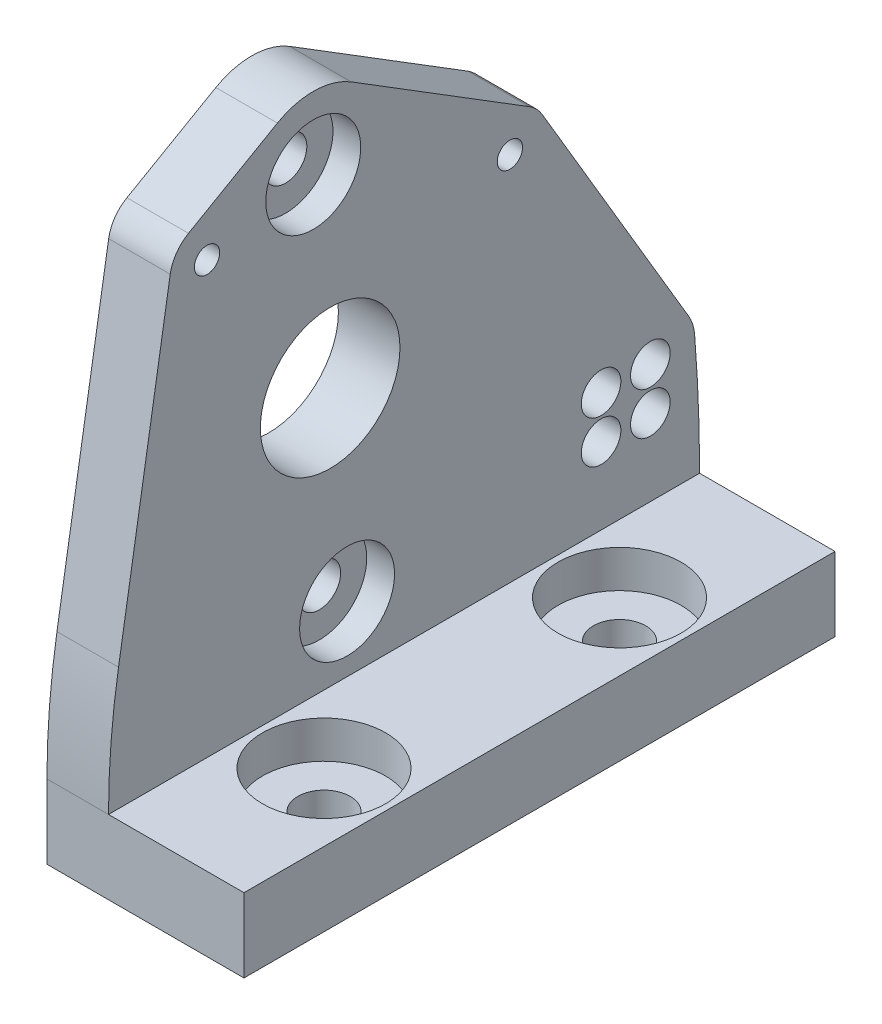
ISO-10303-21;
HEADER;
FILE_DESCRIPTION(('STEP AP214'),'2;1');
FILE_NAME('part.step','',(''),(''),'','','');
FILE_SCHEMA(('AUTOMOTIVE_DESIGN { 1 0 10303 214 1 1 1 1 }'));
ENDSEC;
DATA;
#1=APPLICATION_CONTEXT('core data for automotive mechanical design processes');
#2=APPLICATION_PROTOCOL_DEFINITION('international standard','automotive_design',2000,#1);
#3=PRODUCT_CONTEXT('',#1,'mechanical');
#4=PRODUCT('Part','Part','',(#3));
#5=PRODUCT_RELATED_PRODUCT_CATEGORY('part','',(#4));
#6=PRODUCT_DEFINITION_FORMATION('','',#4);
#7=PRODUCT_DEFINITION_CONTEXT('part definition',#1,'design');
#8=PRODUCT_DEFINITION('design','',#6,#7);
#9=PRODUCT_DEFINITION_SHAPE('','',#8);
#10=(LENGTH_UNIT() NAMED_UNIT(*) SI_UNIT(.MILLI.,.METRE.));
#11=(NAMED_UNIT(*) PLANE_ANGLE_UNIT() SI_UNIT($,.RADIAN.));
#12=(NAMED_UNIT(*) SI_UNIT($,.STERADIAN.) SOLID_ANGLE_UNIT());
#13=UNCERTAINTY_MEASURE_WITH_UNIT(LENGTH_MEASURE(1.E-05),#10,'distance_accuracy_value','');
#14=(GEOMETRIC_REPRESENTATION_CONTEXT(3) GLOBAL_UNCERTAINTY_ASSIGNED_CONTEXT((#13)) GLOBAL_UNIT_ASSIGNED_CONTEXT((#10,
#11,#12)) REPRESENTATION_CONTEXT('',''));
#15=CARTESIAN_POINT('',(0.,0.,0.));
#16=DIRECTION('',(0.,0.,1.));
#17=DIRECTION('',(1.,0.,0.));
#18=AXIS2_PLACEMENT_3D('',#15,#16,#17);
#19=CARTESIAN_POINT('',(9.525,79.375,76.2));
#20=DIRECTION('',(1.,0.,0.));
#21=DIRECTION('',(0.,-1.,0.));
#22=AXIS2_PLACEMENT_3D('',#19,#20,#21);
#23=PLANE('',#22);
#24=CARTESIAN_POINT('',(9.52499999999999,42.8625,47.625));
#25=DIRECTION('',(1.,0.,0.));
#26=DIRECTION('',(0.,0.,-1.));
#27=AXIS2_PLACEMENT_3D('',#24,#25,#26);
#28=CIRCLE('',#27,8.99999999999999);
#29=CARTESIAN_POINT('',(9.52499999999999,42.8625,38.625));
#30=VERTEX_POINT('',#29);
#31=EDGE_CURVE('E288',#30,#30,#28,.T.);
#32=ORIENTED_EDGE('',*,*,#31,.T.);
#33=EDGE_LOOP('',(#32));
#34=FACE_BOUND('',#33,.T.);
#35=CARTESIAN_POINT('',(9.52499999999999,17.957632509851,45.4461064279965));
#36=DIRECTION('',(-1.,0.,0.));
#37=DIRECTION('',(0.,-1.,0.));
#38=AXIS2_PLACEMENT_3D('',#35,#36,#37);
#39=CIRCLE('',#38,2.74999999999999);
#40=CARTESIAN_POINT('',(9.52499999999999,15.207632509851,45.4461064279965));
#41=VERTEX_POINT('',#40);
#42=EDGE_CURVE('E287',#41,#41,#39,.T.);
#43=ORIENTED_EDGE('',*,*,#42,.F.);
#44=EDGE_LOOP('',(#43));
#45=FACE_BOUND('',#44,.T.);
#46=CARTESIAN_POINT('',(9.525,67.767367490149,49.8038935720035));
#47=DIRECTION('',(-1.,0.,0.));
#48=DIRECTION('',(0.,-1.,0.));
#49=AXIS2_PLACEMENT_3D('',#46,#47,#48);
#50=CIRCLE('',#49,2.74999999999999);
#51=CARTESIAN_POINT('',(9.525,65.017367490149,49.8038935720035));
#52=VERTEX_POINT('',#51);
#53=EDGE_CURVE('E277',#52,#52,#50,.T.);
#54=ORIENTED_EDGE('',*,*,#53,.F.);
#55=EDGE_LOOP('',(#54));
#56=FACE_BOUND('',#55,.T.);
#57=CARTESIAN_POINT('',(9.525,65.0875,63.5));
#58=DIRECTION('',(1.,0.,0.));
#59=DIRECTION('',(0.,0.,-1.));
#60=AXIS2_PLACEMENT_3D('',#57,#58,#59);
#61=CIRCLE('',#60,2.77876000000001);
#62=CARTESIAN_POINT('',(9.525,65.0875,60.72124));
#63=VERTEX_POINT('',#62);
#64=EDGE_CURVE('E258',#63,#63,#61,.T.);
#65=ORIENTED_EDGE('',*,*,#64,.T.);
#66=EDGE_LOOP('',(#65));
#67=FACE_BOUND('',#66,.T.);
#68=CARTESIAN_POINT('',(9.525,57.3206231212675,24.4532731370692));
#69=DIRECTION('',(1.,0.,0.));
#70=DIRECTION('',(0.,0.,-1.));
#71=AXIS2_PLACEMENT_3D('',#68,#69,#70);
#72=CIRCLE('',#71,2.77876);
#73=CARTESIAN_POINT('',(9.525,57.3206231212675,21.6745131370692));
#74=VERTEX_POINT('',#73);
#75=EDGE_CURVE('E248',#74,#74,#72,.T.);
#76=ORIENTED_EDGE('',*,*,#75,.T.);
#77=EDGE_LOOP('',(#76));
#78=FACE_BOUND('',#77,.T.);
#79=CARTESIAN_POINT('',(9.52499999999999,19.3959598742133,12.7));
#80=DIRECTION('',(-1.,0.,0.));
#81=DIRECTION('',(0.,0.,1.));
#82=AXIS2_PLACEMENT_3D('',#79,#80,#81);
#83=CIRCLE('',#82,2.5527);
#84=CARTESIAN_POINT('',(9.52499999999999,19.3959598742133,15.2527));
#85=VERTEX_POINT('',#84);
#86=EDGE_CURVE('E245',#85,#85,#83,.T.);
#87=ORIENTED_EDGE('',*,*,#86,.F.);
#88=EDGE_LOOP('',(#87));
#89=FACE_BOUND('',#88,.T.);
#90=CARTESIAN_POINT('',(9.52499999999999,19.3959598742133,6.35));
#91=DIRECTION('',(-1.,0.,0.));
#92=DIRECTION('',(0.,0.,1.));
#93=AXIS2_PLACEMENT_3D('',#90,#91,#92);
#94=CIRCLE('',#93,2.5527);
#95=CARTESIAN_POINT('',(9.52499999999999,19.3959598742133,8.9027));
#96=VERTEX_POINT('',#95);
#97=EDGE_CURVE('E239',#96,#96,#94,.T.);
#98=ORIENTED_EDGE('',*,*,#97,.F.);
#99=EDGE_LOOP('',(#98));
#100=FACE_BOUND('',#99,.T.);
#101=CARTESIAN_POINT('',(9.52499999999999,24.8635494141295,12.7));
#102=DIRECTION('',(-1.,0.,0.));
#103=DIRECTION('',(0.,0.,1.));
#104=AXIS2_PLACEMENT_3D('',#101,#102,#103);
#105=CIRCLE('',#104,2.5527);
#106=CARTESIAN_POINT('',(9.52499999999999,24.8635494141295,15.2527));
#107=VERTEX_POINT('',#106);
#108=EDGE_CURVE('E233',#107,#107,#105,.T.);
#109=ORIENTED_EDGE('',*,*,#108,.F.);
#110=EDGE_LOOP('',(#109));
#111=FACE_BOUND('',#110,.T.);
#112=CARTESIAN_POINT('',(9.52499999999999,24.8635494141295,6.35));
#113=DIRECTION('',(-1.,0.,0.));
#114=DIRECTION('',(0.,0.,1.));
#115=AXIS2_PLACEMENT_3D('',#112,#113,#114);
#116=CIRCLE('',#115,2.5527);
#117=CARTESIAN_POINT('',(9.52499999999999,24.8635494141295,8.9027));
#118=VERTEX_POINT('',#117);
#119=EDGE_CURVE('E227',#118,#118,#116,.T.);
#120=ORIENTED_EDGE('',*,*,#119,.F.);
#121=EDGE_LOOP('',(#120));
#122=FACE_BOUND('',#121,.T.);
#123=CARTESIAN_POINT('',(9.52499999999999,9.525,195.072353237744));
#124=DIRECTION('',(1.,0.,0.));
#125=DIRECTION('',(0.,0.,-1.));
#126=AXIS2_PLACEMENT_3D('',#123,#124,#125);
#127=CIRCLE('',#126,195.072353237744);
#128=CARTESIAN_POINT('',(9.52499999999999,9.52500000000002,0.));
#129=VERTEX_POINT('',#128);
#130=CARTESIAN_POINT('',(9.52499999999999,25.3275424975202,0.641124654665709));
#131=VERTEX_POINT('',#130);
#132=EDGE_CURVE('E195',#129,#131,#127,.T.);
#133=ORIENTED_EDGE('',*,*,#132,.F.);
#134=DIRECTION('',(0.,1.,0.));
#135=VECTOR('',#134,1.);
#136=CARTESIAN_POINT('',(9.525,79.375,0.));
#137=LINE('',#136,#135);
#138=CARTESIAN_POINT('',(9.52499999999999,0.,0.));
#139=VERTEX_POINT('',#138);
#140=EDGE_CURVE('E304',#139,#129,#137,.T.);
#141=ORIENTED_EDGE('',*,*,#140,.F.);
#142=DIRECTION('',(0.,0.,-1.));
#143=VECTOR('',#142,1.);
#144=CARTESIAN_POINT('',(9.52499999999999,0.,76.2));
#145=LINE('',#144,#143);
#146=CARTESIAN_POINT('',(9.52499999999999,0.,76.2));
#147=VERTEX_POINT('',#146);
#148=EDGE_CURVE('E317',#147,#139,#145,.T.);
#149=ORIENTED_EDGE('',*,*,#148,.F.);
#150=DIRECTION('',(0.,1.,0.));
#151=VECTOR('',#150,1.);
#152=CARTESIAN_POINT('',(9.525,79.375,76.2));
#153=LINE('',#152,#151);
#154=CARTESIAN_POINT('',(9.52499999999999,9.525,76.2));
#155=VERTEX_POINT('',#154);
#156=EDGE_CURVE('E168',#147,#155,#153,.T.);
#157=ORIENTED_EDGE('',*,*,#156,.T.);
#158=CARTESIAN_POINT('',(9.52499999999999,9.525,-21.192786763509));
#159=DIRECTION('',(1.,0.,0.));
#160=DIRECTION('',(0.,0.,-1.));
#161=AXIS2_PLACEMENT_3D('',#158,#159,#160);
#162=CIRCLE('',#161,97.392786763509);
#163=CARTESIAN_POINT('',(9.52499999999999,25.3275424975202,74.9094221818446));
#164=VERTEX_POINT('',#163);
#165=EDGE_CURVE('E148',#164,#155,#162,.T.);
#166=ORIENTED_EDGE('',*,*,#165,.F.);
#167=DIRECTION('',(0.,-0.986748733032055,0.162255779125535));
#168=VECTOR('',#167,1.);
#169=CARTESIAN_POINT('',(9.52499999999999,12.6602209498388,76.9923700067049));
#170=LINE('',#169,#168);
#171=CARTESIAN_POINT('',(9.52499999999999,65.8674554174675,68.2432518222484));
#172=VERTEX_POINT('',#171);
#173=EDGE_CURVE('E159',#172,#164,#170,.T.);
#174=ORIENTED_EDGE('',*,*,#173,.F.);
#175=CARTESIAN_POINT('',(9.52499999999999,65.0875,63.5));
#176=DIRECTION('',(1.,0.,0.));
#177=DIRECTION('',(0.,0.,-1.));
#178=AXIS2_PLACEMENT_3D('',#175,#176,#177);
#179=CIRCLE('',#178,4.80694999999999);
#180=CARTESIAN_POINT('',(9.52499999999999,69.2575503932797,65.8911185708802));
#181=VERTEX_POINT('',#180);
#182=EDGE_CURVE('E164',#172,#181,#179,.F.);
#183=ORIENTED_EDGE('',*,*,#182,.T.);
#184=DIRECTION('',(0.,-0.497429465852599,0.867504424485315));
#185=VECTOR('',#184,1.);
#186=CARTESIAN_POINT('',(9.52499999999999,80.55421862798,46.1900144982694));
#187=LINE('',#186,#185);
#188=CARTESIAN_POINT('',(9.52499999999999,75.8308211157401,54.4275004571034));
#189=VERTEX_POINT('',#188);
#190=EDGE_CURVE('E177',#189,#181,#187,.T.);
#191=ORIENTED_EDGE('',*,*,#190,.F.);
#192=CARTESIAN_POINT('',(9.52499999999999,67.767367490149,49.8038935720035));
#193=DIRECTION('',(1.,0.,0.));
#194=DIRECTION('',(0.,0.,-1.));
#195=AXIS2_PLACEMENT_3D('',#192,#193,#194);
#196=CIRCLE('',#195,9.295);
#197=CARTESIAN_POINT('',(9.52499999999999,75.665670144044,44.9035017318059));
#198=VERTEX_POINT('',#197);
#199=EDGE_CURVE('E180',#189,#198,#196,.F.);
#200=ORIENTED_EDGE('',*,*,#199,.T.);
#201=DIRECTION('',(0.,0.527207298568868,0.849736702947281));
#202=VECTOR('',#201,1.);
#203=CARTESIAN_POINT('',(9.52499999999999,34.5183809760836,-21.416448556655));
#204=LINE('',#203,#202);
#205=CARTESIAN_POINT('',(9.52499999999999,61.4052649655,21.9190140132136));
#206=VERTEX_POINT('',#205);
#207=EDGE_CURVE('E183',#206,#198,#204,.T.);
#208=ORIENTED_EDGE('',*,*,#207,.F.);
#209=CARTESIAN_POINT('',(9.52499999999999,57.3206231212675,24.4532731370692));
#210=DIRECTION('',(1.,0.,0.));
#211=DIRECTION('',(0.,0.,-1.));
#212=AXIS2_PLACEMENT_3D('',#209,#210,#211);
#213=CIRCLE('',#212,4.80694999999999);
#214=CARTESIAN_POINT('',(9.52499999999999,59.7654438476144,20.3144786364296));
#215=VERTEX_POINT('',#214);
#216=EDGE_CURVE('E186',#206,#215,#213,.F.);
#217=ORIENTED_EDGE('',*,*,#216,.T.);
#218=DIRECTION('',(0.,-0.861002194871929,-0.508601239111468));
#219=VECTOR('',#218,1.);
#220=CARTESIAN_POINT('',(9.52499999999999,6.56399136927082,-11.1120668638873));
#221=LINE('',#220,#219);
#222=CARTESIAN_POINT('',(9.52499999999999,27.7766647313883,1.41843772843205));
#223=VERTEX_POINT('',#222);
#224=EDGE_CURVE('E189',#215,#223,#221,.T.);
#225=ORIENTED_EDGE('',*,*,#224,.T.);
#226=CARTESIAN_POINT('',(9.52499999999999,24.8635494141295,6.35));
#227=DIRECTION('',(1.,0.,0.));
#228=DIRECTION('',(0.,0.,-1.));
#229=AXIS2_PLACEMENT_3D('',#226,#227,#228);
#230=CIRCLE('',#229,5.7277);
#231=EDGE_CURVE('E192',#223,#131,#230,.F.);
#232=ORIENTED_EDGE('',*,*,#231,.T.);
#233=EDGE_LOOP('',(#133,#141,#149,#157,#166,#174,#183,#191,#200,#208,#217,#225,#232));
#234=FACE_BOUND('',#233,.T.);
#235=ADVANCED_FACE('F35',(#34,#45,#56,#67,#78,#89,#100,#111,#122,#234),#23,.F.);
#236=CARTESIAN_POINT('',(17.4625,9.525,76.2));
#237=DIRECTION('',(-1.,0.,0.));
#238=DIRECTION('',(0.,0.,-1.));
#239=AXIS2_PLACEMENT_3D('',#236,#237,#238);
#240=PLANE('',#239);
#241=CARTESIAN_POINT('',(17.4625,42.8625,47.625));
#242=DIRECTION('',(1.,0.,0.));
#243=DIRECTION('',(0.,0.,-1.));
#244=AXIS2_PLACEMENT_3D('',#241,#242,#243);
#245=CIRCLE('',#244,8.99999999999999);
#246=CARTESIAN_POINT('',(17.4625,42.8625,38.625));
#247=VERTEX_POINT('',#246);
#248=EDGE_CURVE('E291',#247,#247,#245,.T.);
#249=ORIENTED_EDGE('',*,*,#248,.F.);
#250=EDGE_LOOP('',(#249));
#251=FACE_BOUND('',#250,.T.);
#252=CARTESIAN_POINT('',(17.4625,17.957632509851,45.4461064279965));
#253=DIRECTION('',(-1.,0.,0.));
#254=DIRECTION('',(0.,0.,1.));
#255=AXIS2_PLACEMENT_3D('',#252,#253,#254);
#256=CIRCLE('',#255,6.12);
#257=CARTESIAN_POINT('',(17.4625,17.957632509851,51.5661064279965));
#258=VERTEX_POINT('',#257);
#259=EDGE_CURVE('E278',#258,#258,#256,.T.);
#260=ORIENTED_EDGE('',*,*,#259,.T.);
#261=EDGE_LOOP('',(#260));
#262=FACE_BOUND('',#261,.T.);
#263=CARTESIAN_POINT('',(17.4625,67.767367490149,49.8038935720035));
#264=DIRECTION('',(-1.,0.,0.));
#265=DIRECTION('',(0.,0.,1.));
#266=AXIS2_PLACEMENT_3D('',#263,#264,#265);
#267=CIRCLE('',#266,6.12);
#268=CARTESIAN_POINT('',(17.4625,67.767367490149,55.9238935720035));
#269=VERTEX_POINT('',#268);
#270=EDGE_CURVE('E268',#269,#269,#267,.T.);
#271=ORIENTED_EDGE('',*,*,#270,.T.);
#272=EDGE_LOOP('',(#271));
#273=FACE_BOUND('',#272,.T.);
#274=CARTESIAN_POINT('',(17.4625,65.0875,63.5));
#275=DIRECTION('',(1.,0.,0.));
#276=DIRECTION('',(0.,0.,-1.));
#277=AXIS2_PLACEMENT_3D('',#274,#275,#276);
#278=CIRCLE('',#277,1.63194999999999);
#279=CARTESIAN_POINT('',(17.4625,65.0875,61.86805));
#280=VERTEX_POINT('',#279);
#281=EDGE_CURVE('E267',#280,#280,#278,.T.);
#282=ORIENTED_EDGE('',*,*,#281,.F.);
#283=EDGE_LOOP('',(#282));
#284=FACE_BOUND('',#283,.T.);
#285=CARTESIAN_POINT('',(17.4625,57.3206231212675,24.4532731370692));
#286=DIRECTION('',(1.,0.,0.));
#287=DIRECTION('',(0.,0.,-1.));
#288=AXIS2_PLACEMENT_3D('',#285,#286,#287);
#289=CIRCLE('',#288,1.63194999999999);
#290=CARTESIAN_POINT('',(17.4625,57.3206231212675,22.8213231370692));
#291=VERTEX_POINT('',#290);
#292=EDGE_CURVE('E257',#291,#291,#289,.T.);
#293=ORIENTED_EDGE('',*,*,#292,.F.);
#294=EDGE_LOOP('',(#293));
#295=FACE_BOUND('',#294,.T.);
#296=CARTESIAN_POINT('',(17.4625,19.3959598742133,12.7));
#297=DIRECTION('',(-1.,0.,0.));
#298=DIRECTION('',(0.,0.,1.));
#299=AXIS2_PLACEMENT_3D('',#296,#297,#298);
#300=CIRCLE('',#299,2.5527);
#301=CARTESIAN_POINT('',(17.4625,19.3959598742133,15.2527));
#302=VERTEX_POINT('',#301);
#303=EDGE_CURVE('E242',#302,#302,#300,.T.);
#304=ORIENTED_EDGE('',*,*,#303,.T.);
#305=EDGE_LOOP('',(#304));
#306=FACE_BOUND('',#305,.T.);
#307=CARTESIAN_POINT('',(17.4625,19.3959598742133,6.35));
#308=DIRECTION('',(-1.,0.,0.));
#309=DIRECTION('',(0.,0.,1.));
#310=AXIS2_PLACEMENT_3D('',#307,#308,#309);
#311=CIRCLE('',#310,2.5527);
#312=CARTESIAN_POINT('',(17.4625,19.3959598742133,8.9027));
#313=VERTEX_POINT('',#312);
#314=EDGE_CURVE('E236',#313,#313,#311,.T.);
#315=ORIENTED_EDGE('',*,*,#314,.T.);
#316=EDGE_LOOP('',(#315));
#317=FACE_BOUND('',#316,.T.);
#318=CARTESIAN_POINT('',(17.4625,24.8635494141295,12.7));
#319=DIRECTION('',(-1.,0.,0.));
#320=DIRECTION('',(0.,0.,1.));
#321=AXIS2_PLACEMENT_3D('',#318,#319,#320);
#322=CIRCLE('',#321,2.5527);
#323=CARTESIAN_POINT('',(17.4625,24.8635494141295,15.2527));
#324=VERTEX_POINT('',#323);
#325=EDGE_CURVE('E230',#324,#324,#322,.T.);
#326=ORIENTED_EDGE('',*,*,#325,.T.);
#327=EDGE_LOOP('',(#326));
#328=FACE_BOUND('',#327,.T.);
#329=CARTESIAN_POINT('',(17.4625,24.8635494141295,6.35));
#330=DIRECTION('',(-1.,0.,0.));
#331=DIRECTION('',(0.,0.,1.));
#332=AXIS2_PLACEMENT_3D('',#329,#330,#331);
#333=CIRCLE('',#332,2.5527);
#334=CARTESIAN_POINT('',(17.4625,24.8635494141295,8.9027));
#335=VERTEX_POINT('',#334);
#336=EDGE_CURVE('E224',#335,#335,#333,.T.);
#337=ORIENTED_EDGE('',*,*,#336,.T.);
#338=EDGE_LOOP('',(#337));
#339=FACE_BOUND('',#338,.T.);
#340=CARTESIAN_POINT('',(17.4625,9.525,195.072353237744));
#341=DIRECTION('',(1.,0.,0.));
#342=DIRECTION('',(0.,0.,-1.));
#343=AXIS2_PLACEMENT_3D('',#340,#341,#342);
#344=CIRCLE('',#343,195.072353237744);
#345=CARTESIAN_POINT('',(17.4625,9.525,0.));
#346=VERTEX_POINT('',#345);
#347=CARTESIAN_POINT('',(17.4625,25.3275424975202,0.641124654665709));
#348=VERTEX_POINT('',#347);
#349=EDGE_CURVE('E217',#346,#348,#344,.T.);
#350=ORIENTED_EDGE('',*,*,#349,.T.);
#351=CARTESIAN_POINT('',(17.4625,24.8635494141295,6.35));
#352=DIRECTION('',(1.,0.,0.));
#353=DIRECTION('',(0.,0.,-1.));
#354=AXIS2_PLACEMENT_3D('',#351,#352,#353);
#355=CIRCLE('',#354,5.7277);
#356=CARTESIAN_POINT('',(17.4625,27.7766647313883,1.41843772843204));
#357=VERTEX_POINT('',#356);
#358=EDGE_CURVE('E11',#357,#348,#355,.F.);
#359=ORIENTED_EDGE('',*,*,#358,.F.);
#360=DIRECTION('',(0.,0.861002194871929,0.508601239111468));
#361=VECTOR('',#360,1.);
#362=CARTESIAN_POINT('',(17.4625,46.9936067737601,12.7700470424331));
#363=LINE('',#362,#361);
#364=CARTESIAN_POINT('',(17.4625,59.7654438476144,20.3144786364296));
#365=VERTEX_POINT('',#364);
#366=EDGE_CURVE('E319',#357,#365,#363,.T.);
#367=ORIENTED_EDGE('',*,*,#366,.T.);
#368=CARTESIAN_POINT('',(17.4625,57.3206231212675,24.4532731370692));
#369=DIRECTION('',(1.,0.,0.));
#370=DIRECTION('',(0.,0.,-1.));
#371=AXIS2_PLACEMENT_3D('',#368,#369,#370);
#372=CIRCLE('',#371,4.80694999999999);
#373=CARTESIAN_POINT('',(17.4625,61.4052649655,21.9190140132136));
#374=VERTEX_POINT('',#373);
#375=EDGE_CURVE('E330',#365,#374,#372,.T.);
#376=ORIENTED_EDGE('',*,*,#375,.T.);
#377=DIRECTION('',(0.,-0.527207298568868,-0.849736702947281));
#378=VECTOR('',#377,1.);
#379=CARTESIAN_POINT('',(17.4625,71.3024704974467,37.8710291312467));
#380=LINE('',#379,#378);
#381=CARTESIAN_POINT('',(17.4625,75.665670144044,44.9035017318059));
#382=VERTEX_POINT('',#381);
#383=EDGE_CURVE('E333',#382,#374,#380,.T.);
#384=ORIENTED_EDGE('',*,*,#383,.F.);
#385=CARTESIAN_POINT('',(17.4625,67.767367490149,49.8038935720035));
#386=DIRECTION('',(1.,0.,0.));
#387=DIRECTION('',(0.,0.,-1.));
#388=AXIS2_PLACEMENT_3D('',#385,#386,#387);
#389=CIRCLE('',#388,9.295);
#390=CARTESIAN_POINT('',(17.4625,75.8308211157401,54.4275004571034));
#391=VERTEX_POINT('',#390);
#392=EDGE_CURVE('E336',#382,#391,#389,.T.);
#393=ORIENTED_EDGE('',*,*,#392,.T.);
#394=DIRECTION('',(0.,0.497429465852599,-0.867504424485315));
#395=VECTOR('',#394,1.);
#396=CARTESIAN_POINT('',(17.4625,50.0290508258192,99.425136147412));
#397=LINE('',#396,#395);
#398=CARTESIAN_POINT('',(17.4625,69.2575503932797,65.8911185708802));
#399=VERTEX_POINT('',#398);
#400=EDGE_CURVE('E339',#399,#391,#397,.T.);
#401=ORIENTED_EDGE('',*,*,#400,.F.);
#402=CARTESIAN_POINT('',(17.4625,65.0875,63.5));
#403=DIRECTION('',(1.,0.,0.));
#404=DIRECTION('',(0.,0.,-1.));
#405=AXIS2_PLACEMENT_3D('',#402,#403,#404);
#406=CIRCLE('',#405,4.80694999999999);
#407=CARTESIAN_POINT('',(17.4625,65.8674554174675,68.2432518222484));
#408=VERTEX_POINT('',#407);
#409=EDGE_CURVE('E342',#399,#408,#406,.T.);
#410=ORIENTED_EDGE('',*,*,#409,.T.);
#411=DIRECTION('',(0.,0.986748733032055,-0.162255779125535));
#412=VECTOR('',#411,1.);
#413=CARTESIAN_POINT('',(17.4625,9.73440370940694,77.4734760269442));
#414=LINE('',#413,#412);
#415=CARTESIAN_POINT('',(17.4625,25.3275424975202,74.9094221818446));
#416=VERTEX_POINT('',#415);
#417=EDGE_CURVE('E43',#416,#408,#414,.T.);
#418=ORIENTED_EDGE('',*,*,#417,.F.);
#419=CARTESIAN_POINT('',(17.4625,9.525,-21.192786763509));
#420=DIRECTION('',(1.,0.,0.));
#421=DIRECTION('',(0.,0.,-1.));
#422=AXIS2_PLACEMENT_3D('',#419,#420,#421);
#423=CIRCLE('',#422,97.392786763509);
#424=CARTESIAN_POINT('',(17.4625,9.525,76.2));
#425=VERTEX_POINT('',#424);
#426=EDGE_CURVE('E151',#425,#416,#423,.F.);
#427=ORIENTED_EDGE('',*,*,#426,.F.);
#428=DIRECTION('',(0.,0.,-1.));
#429=VECTOR('',#428,1.);
#430=CARTESIAN_POINT('',(17.4625,9.525,76.2));
#431=LINE('',#430,#429);
#432=EDGE_CURVE('E314',#425,#346,#431,.T.);
#433=ORIENTED_EDGE('',*,*,#432,.T.);
#434=EDGE_LOOP('',(#350,#359,#367,#376,#384,#393,#401,#410,#418,#427,#433));
#435=FACE_BOUND('',#434,.T.);
#436=ADVANCED_FACE('F347',(#251,#262,#273,#284,#295,#306,#317,#328,#339,#435),#240,.F.);
#437=CARTESIAN_POINT('',(34.925,0.,76.2));
#438=DIRECTION('',(0.,0.,-1.));
#439=DIRECTION('',(1.,0.,0.));
#440=AXIS2_PLACEMENT_3D('',#437,#438,#439);
#441=PLANE('',#440);
#442=DIRECTION('',(1.,0.,0.));
#443=VECTOR('',#442,1.);
#444=CARTESIAN_POINT('',(9.52499999999999,9.525,76.2));
#445=LINE('',#444,#443);
#446=EDGE_CURVE('E196',#155,#425,#445,.T.);
#447=ORIENTED_EDGE('',*,*,#446,.F.);
#448=ORIENTED_EDGE('',*,*,#156,.F.);
#449=DIRECTION('',(-1.,0.,0.));
#450=VECTOR('',#449,1.);
#451=CARTESIAN_POINT('',(9.52499999999999,0.,76.2));
#452=LINE('',#451,#450);
#453=CARTESIAN_POINT('',(34.925,0.,76.2));
#454=VERTEX_POINT('',#453);
#455=EDGE_CURVE('E77',#454,#147,#452,.T.);
#456=ORIENTED_EDGE('',*,*,#455,.F.);
#457=DIRECTION('',(0.,-1.,0.));
#458=VECTOR('',#457,1.);
#459=CARTESIAN_POINT('',(34.925,0.,76.2));
#460=LINE('',#459,#458);
#461=CARTESIAN_POINT('',(34.925,9.525,76.2));
#462=VERTEX_POINT('',#461);
#463=EDGE_CURVE('E301',#462,#454,#460,.T.);
#464=ORIENTED_EDGE('',*,*,#463,.F.);
#465=DIRECTION('',(1.,0.,0.));
#466=VECTOR('',#465,1.);
#467=CARTESIAN_POINT('',(34.925,9.525,76.2));
#468=LINE('',#467,#466);
#469=EDGE_CURVE('E298',#425,#462,#468,.T.);
#470=ORIENTED_EDGE('',*,*,#469,.F.);
#471=EDGE_LOOP('',(#447,#448,#456,#464,#470));
#472=FACE_BOUND('',#471,.T.);
#473=ADVANCED_FACE('F391',(#472),#441,.F.);
#474=CARTESIAN_POINT('',(34.925,0.,0.));
#475=DIRECTION('',(0.,0.,-1.));
#476=DIRECTION('',(1.,0.,0.));
#477=AXIS2_PLACEMENT_3D('',#474,#475,#476);
#478=PLANE('',#477);
#479=DIRECTION('',(1.,0.,0.));
#480=VECTOR('',#479,1.);
#481=CARTESIAN_POINT('',(34.925,9.525,0.));
#482=LINE('',#481,#480);
#483=CARTESIAN_POINT('',(34.925,9.525,0.));
#484=VERTEX_POINT('',#483);
#485=EDGE_CURVE('E306',#346,#484,#482,.T.);
#486=ORIENTED_EDGE('',*,*,#485,.T.);
#487=DIRECTION('',(0.,-1.,0.));
#488=VECTOR('',#487,1.);
#489=CARTESIAN_POINT('',(34.925,0.,0.));
#490=LINE('',#489,#488);
#491=CARTESIAN_POINT('',(34.925,0.,0.));
#492=VERTEX_POINT('',#491);
#493=EDGE_CURVE('E296',#484,#492,#490,.T.);
#494=ORIENTED_EDGE('',*,*,#493,.T.);
#495=DIRECTION('',(-1.,0.,0.));
#496=VECTOR('',#495,1.);
#497=CARTESIAN_POINT('',(9.52499999999999,0.,0.));
#498=LINE('',#497,#496);
#499=EDGE_CURVE('E294',#492,#139,#498,.T.);
#500=ORIENTED_EDGE('',*,*,#499,.T.);
#501=ORIENTED_EDGE('',*,*,#140,.T.);
#502=DIRECTION('',(1.,0.,0.));
#503=VECTOR('',#502,1.);
#504=CARTESIAN_POINT('',(9.52499999999999,9.525,0.));
#505=LINE('',#504,#503);
#506=EDGE_CURVE('E50',#129,#346,#505,.T.);
#507=ORIENTED_EDGE('',*,*,#506,.T.);
#508=EDGE_LOOP('',(#486,#494,#500,#501,#507));
#509=FACE_BOUND('',#508,.T.);
#510=ADVANCED_FACE('F381',(#509),#478,.T.);
#511=CARTESIAN_POINT('',(9.52499999999999,0.,76.2));
#512=DIRECTION('',(0.,1.,0.));
#513=DIRECTION('',(0.,0.,1.));
#514=AXIS2_PLACEMENT_3D('',#511,#512,#513);
#515=PLANE('',#514);
#516=CARTESIAN_POINT('',(26.19375,0.,19.05));
#517=DIRECTION('',(0.,-1.,0.));
#518=DIRECTION('',(0.,0.,1.));
#519=AXIS2_PLACEMENT_3D('',#516,#517,#518);
#520=CIRCLE('',#519,3.3782);
#521=CARTESIAN_POINT('',(26.19375,0.,22.4282));
#522=VERTEX_POINT('',#521);
#523=EDGE_CURVE('E535',#522,#522,#520,.T.);
#524=ORIENTED_EDGE('',*,*,#523,.F.);
#525=EDGE_LOOP('',(#524));
#526=FACE_BOUND('',#525,.T.);
#527=CARTESIAN_POINT('',(26.19375,0.,57.15));
#528=DIRECTION('',(0.,-1.,0.));
#529=DIRECTION('',(0.,0.,1.));
#530=AXIS2_PLACEMENT_3D('',#527,#528,#529);
#531=CIRCLE('',#530,3.3782);
#532=CARTESIAN_POINT('',(26.19375,0.,60.5282));
#533=VERTEX_POINT('',#532);
#534=EDGE_CURVE('E169',#533,#533,#531,.T.);
#535=ORIENTED_EDGE('',*,*,#534,.F.);
#536=EDGE_LOOP('',(#535));
#537=FACE_BOUND('',#536,.T.);
#538=ORIENTED_EDGE('',*,*,#499,.F.);
#539=DIRECTION('',(0.,0.,-1.));
#540=VECTOR('',#539,1.);
#541=CARTESIAN_POINT('',(34.925,0.,76.2));
#542=LINE('',#541,#540);
#543=EDGE_CURVE('E59',#454,#492,#542,.T.);
#544=ORIENTED_EDGE('',*,*,#543,.F.);
#545=ORIENTED_EDGE('',*,*,#455,.T.);
#546=ORIENTED_EDGE('',*,*,#148,.T.);
#547=EDGE_LOOP('',(#538,#544,#545,#546));
#548=FACE_BOUND('',#547,.T.);
#549=ADVANCED_FACE('F37',(#526,#537,#548),#515,.F.);
#550=CARTESIAN_POINT('',(34.925,9.525,76.2));
#551=DIRECTION('',(0.,-1.,0.));
#552=DIRECTION('',(0.,0.,-1.));
#553=AXIS2_PLACEMENT_3D('',#550,#551,#552);
#554=PLANE('',#553);
#555=CARTESIAN_POINT('',(26.19375,9.525,19.05));
#556=DIRECTION('',(0.,-1.,0.));
#557=DIRECTION('',(0.,0.,1.));
#558=AXIS2_PLACEMENT_3D('',#555,#556,#557);
#559=CIRCLE('',#558,7.9375);
#560=CARTESIAN_POINT('',(26.19375,9.525,26.9875));
#561=VERTEX_POINT('',#560);
#562=EDGE_CURVE('E528',#561,#561,#559,.T.);
#563=ORIENTED_EDGE('',*,*,#562,.T.);
#564=EDGE_LOOP('',(#563));
#565=FACE_BOUND('',#564,.T.);
#566=CARTESIAN_POINT('',(26.19375,9.525,57.15));
#567=DIRECTION('',(0.,-1.,0.));
#568=DIRECTION('',(0.,0.,1.));
#569=AXIS2_PLACEMENT_3D('',#566,#567,#568);
#570=CIRCLE('',#569,7.9375);
#571=CARTESIAN_POINT('',(26.19375,9.525,65.0875));
#572=VERTEX_POINT('',#571);
#573=EDGE_CURVE('E538',#572,#572,#570,.T.);
#574=ORIENTED_EDGE('',*,*,#573,.T.);
#575=EDGE_LOOP('',(#574));
#576=FACE_BOUND('',#575,.T.);
#577=ORIENTED_EDGE('',*,*,#485,.F.);
#578=ORIENTED_EDGE('',*,*,#432,.F.);
#579=ORIENTED_EDGE('',*,*,#469,.T.);
#580=DIRECTION('',(0.,0.,-1.));
#581=VECTOR('',#580,1.);
#582=CARTESIAN_POINT('',(34.925,9.525,76.2));
#583=LINE('',#582,#581);
#584=EDGE_CURVE('E312',#462,#484,#583,.T.);
#585=ORIENTED_EDGE('',*,*,#584,.T.);
#586=EDGE_LOOP('',(#577,#578,#579,#585));
#587=FACE_BOUND('',#586,.T.);
#588=ADVANCED_FACE('F378',(#565,#576,#587),#554,.F.);
#589=CARTESIAN_POINT('',(34.925,0.,76.2));
#590=DIRECTION('',(-1.,0.,0.));
#591=DIRECTION('',(0.,0.,-1.));
#592=AXIS2_PLACEMENT_3D('',#589,#590,#591);
#593=PLANE('',#592);
#594=ORIENTED_EDGE('',*,*,#493,.F.);
#595=ORIENTED_EDGE('',*,*,#584,.F.);
#596=ORIENTED_EDGE('',*,*,#463,.T.);
#597=ORIENTED_EDGE('',*,*,#543,.T.);
#598=EDGE_LOOP('',(#594,#595,#596,#597));
#599=FACE_BOUND('',#598,.T.);
#600=ADVANCED_FACE('F388',(#599),#593,.F.);
#601=CARTESIAN_POINT('',(9.52499999999999,42.8625,47.625));
#602=DIRECTION('',(-1.,0.,0.));
#603=DIRECTION('',(0.,0.,-1.));
#604=AXIS2_PLACEMENT_3D('',#601,#602,#603);
#605=CYLINDRICAL_SURFACE('',#604,8.99999999999999);
#606=ORIENTED_EDGE('',*,*,#31,.F.);
#607=EDGE_LOOP('',(#606));
#608=FACE_BOUND('',#607,.T.);
#609=ORIENTED_EDGE('',*,*,#248,.T.);
#610=EDGE_LOOP('',(#609));
#611=FACE_BOUND('',#610,.T.);
#612=ADVANCED_FACE('F405',(#608,#611),#605,.F.);
#613=CARTESIAN_POINT('',(17.4625,17.957632509851,45.4461064279965));
#614=DIRECTION('',(1.,0.,0.));
#615=DIRECTION('',(0.,0.,1.));
#616=AXIS2_PLACEMENT_3D('',#613,#614,#615);
#617=CYLINDRICAL_SURFACE('',#616,2.74999999999999);
#618=CARTESIAN_POINT('',(13.8825,17.957632509851,45.4461064279965));
#619=DIRECTION('',(-1.,0.,0.));
#620=DIRECTION('',(0.,0.,1.));
#621=AXIS2_PLACEMENT_3D('',#618,#619,#620);
#622=CIRCLE('',#621,2.75);
#623=CARTESIAN_POINT('',(13.8825,17.957632509851,48.1961064279965));
#624=VERTEX_POINT('',#623);
#625=EDGE_CURVE('E284',#624,#624,#622,.T.);
#626=ORIENTED_EDGE('',*,*,#625,.F.);
#627=EDGE_LOOP('',(#626));
#628=FACE_BOUND('',#627,.T.);
#629=ORIENTED_EDGE('',*,*,#42,.T.);
#630=EDGE_LOOP('',(#629));
#631=FACE_BOUND('',#630,.T.);
#632=ADVANCED_FACE('F412',(#628,#631),#617,.F.);
#633=CARTESIAN_POINT('',(13.8825,20.707632509851,45.4461064279965));
#634=DIRECTION('',(-1.,0.,0.));
#635=DIRECTION('',(0.,0.,-1.));
#636=AXIS2_PLACEMENT_3D('',#633,#634,#635);
#637=PLANE('',#636);
#638=ORIENTED_EDGE('',*,*,#625,.T.);
#639=EDGE_LOOP('',(#638));
#640=FACE_BOUND('',#639,.T.);
#641=CARTESIAN_POINT('',(13.8825,17.957632509851,45.4461064279965));
#642=DIRECTION('',(-1.,0.,0.));
#643=DIRECTION('',(0.,0.,1.));
#644=AXIS2_PLACEMENT_3D('',#641,#642,#643);
#645=CIRCLE('',#644,6.12);
#646=CARTESIAN_POINT('',(13.8825,17.957632509851,51.5661064279965));
#647=VERTEX_POINT('',#646);
#648=EDGE_CURVE('E281',#647,#647,#645,.T.);
#649=ORIENTED_EDGE('',*,*,#648,.F.);
#650=EDGE_LOOP('',(#649));
#651=FACE_BOUND('',#650,.T.);
#652=ADVANCED_FACE('F416',(#640,#651),#637,.F.);
#653=CARTESIAN_POINT('',(17.4625,17.957632509851,45.4461064279965));
#654=DIRECTION('',(1.,0.,0.));
#655=DIRECTION('',(0.,0.,1.));
#656=AXIS2_PLACEMENT_3D('',#653,#654,#655);
#657=CYLINDRICAL_SURFACE('',#656,6.12);
#658=ORIENTED_EDGE('',*,*,#648,.T.);
#659=EDGE_LOOP('',(#658));
#660=FACE_BOUND('',#659,.T.);
#661=ORIENTED_EDGE('',*,*,#259,.F.);
#662=EDGE_LOOP('',(#661));
#663=FACE_BOUND('',#662,.T.);
#664=ADVANCED_FACE('F420',(#660,#663),#657,.F.);
#665=CARTESIAN_POINT('',(17.4625,67.767367490149,49.8038935720035));
#666=DIRECTION('',(1.,0.,0.));
#667=DIRECTION('',(0.,0.,1.));
#668=AXIS2_PLACEMENT_3D('',#665,#666,#667);
#669=CYLINDRICAL_SURFACE('',#668,2.74999999999999);
#670=CARTESIAN_POINT('',(13.8825,67.767367490149,49.8038935720035));
#671=DIRECTION('',(-1.,0.,0.));
#672=DIRECTION('',(0.,0.,1.));
#673=AXIS2_PLACEMENT_3D('',#670,#671,#672);
#674=CIRCLE('',#673,2.74999999999999);
#675=CARTESIAN_POINT('',(13.8825,67.767367490149,52.5538935720035));
#676=VERTEX_POINT('',#675);
#677=EDGE_CURVE('E274',#676,#676,#674,.T.);
#678=ORIENTED_EDGE('',*,*,#677,.F.);
#679=EDGE_LOOP('',(#678));
#680=FACE_BOUND('',#679,.T.);
#681=ORIENTED_EDGE('',*,*,#53,.T.);
#682=EDGE_LOOP('',(#681));
#683=FACE_BOUND('',#682,.T.);
#684=ADVANCED_FACE('F424',(#680,#683),#669,.F.);
#685=CARTESIAN_POINT('',(13.8825,70.517367490149,49.8038935720035));
#686=DIRECTION('',(-1.,0.,0.));
#687=DIRECTION('',(0.,0.,-1.));
#688=AXIS2_PLACEMENT_3D('',#685,#686,#687);
#689=PLANE('',#688);
#690=ORIENTED_EDGE('',*,*,#677,.T.);
#691=EDGE_LOOP('',(#690));
#692=FACE_BOUND('',#691,.T.);
#693=CARTESIAN_POINT('',(13.8825,67.767367490149,49.8038935720035));
#694=DIRECTION('',(-1.,0.,0.));
#695=DIRECTION('',(0.,0.,1.));
#696=AXIS2_PLACEMENT_3D('',#693,#694,#695);
#697=CIRCLE('',#696,6.12);
#698=CARTESIAN_POINT('',(13.8825,67.767367490149,55.9238935720035));
#699=VERTEX_POINT('',#698);
#700=EDGE_CURVE('E271',#699,#699,#697,.T.);
#701=ORIENTED_EDGE('',*,*,#700,.F.);
#702=EDGE_LOOP('',(#701));
#703=FACE_BOUND('',#702,.T.);
#704=ADVANCED_FACE('F428',(#692,#703),#689,.F.);
#705=CARTESIAN_POINT('',(17.4625,67.767367490149,49.8038935720035));
#706=DIRECTION('',(1.,0.,0.));
#707=DIRECTION('',(0.,0.,1.));
#708=AXIS2_PLACEMENT_3D('',#705,#706,#707);
#709=CYLINDRICAL_SURFACE('',#708,6.12);
#710=ORIENTED_EDGE('',*,*,#700,.T.);
#711=EDGE_LOOP('',(#710));
#712=FACE_BOUND('',#711,.T.);
#713=ORIENTED_EDGE('',*,*,#270,.F.);
#714=EDGE_LOOP('',(#713));
#715=FACE_BOUND('',#714,.T.);
#716=ADVANCED_FACE('F432',(#712,#715),#709,.F.);
#717=CARTESIAN_POINT('',(9.525,65.0875,63.5));
#718=DIRECTION('',(-1.,0.,0.));
#719=DIRECTION('',(0.,0.,-1.));
#720=AXIS2_PLACEMENT_3D('',#717,#718,#719);
#721=CYLINDRICAL_SURFACE('',#720,1.63194999999999);
#722=CARTESIAN_POINT('',(12.3698,65.0875,63.5));
#723=DIRECTION('',(1.,0.,0.));
#724=DIRECTION('',(0.,0.,-1.));
#725=AXIS2_PLACEMENT_3D('',#722,#723,#724);
#726=CIRCLE('',#725,1.63194999999999);
#727=CARTESIAN_POINT('',(12.3698,65.0875,61.86805));
#728=VERTEX_POINT('',#727);
#729=EDGE_CURVE('E264',#728,#728,#726,.T.);
#730=ORIENTED_EDGE('',*,*,#729,.F.);
#731=EDGE_LOOP('',(#730));
#732=FACE_BOUND('',#731,.T.);
#733=ORIENTED_EDGE('',*,*,#281,.T.);
#734=EDGE_LOOP('',(#733));
#735=FACE_BOUND('',#734,.T.);
#736=ADVANCED_FACE('F436',(#732,#735),#721,.F.);
#737=CARTESIAN_POINT('',(12.3698,66.71945,63.5));
#738=DIRECTION('',(1.,0.,0.));
#739=DIRECTION('',(0.,0.,1.));
#740=AXIS2_PLACEMENT_3D('',#737,#738,#739);
#741=PLANE('',#740);
#742=ORIENTED_EDGE('',*,*,#729,.T.);
#743=EDGE_LOOP('',(#742));
#744=FACE_BOUND('',#743,.T.);
#745=CARTESIAN_POINT('',(12.3698,65.0875,63.5));
#746=DIRECTION('',(1.,0.,0.));
#747=DIRECTION('',(0.,0.,-1.));
#748=AXIS2_PLACEMENT_3D('',#745,#746,#747);
#749=CIRCLE('',#748,2.77876000000001);
#750=CARTESIAN_POINT('',(12.3698,65.0875,60.72124));
#751=VERTEX_POINT('',#750);
#752=EDGE_CURVE('E261',#751,#751,#749,.T.);
#753=ORIENTED_EDGE('',*,*,#752,.F.);
#754=EDGE_LOOP('',(#753));
#755=FACE_BOUND('',#754,.T.);
#756=ADVANCED_FACE('F440',(#744,#755),#741,.F.);
#757=CARTESIAN_POINT('',(9.525,65.0875,63.5));
#758=DIRECTION('',(-1.,0.,0.));
#759=DIRECTION('',(0.,0.,-1.));
#760=AXIS2_PLACEMENT_3D('',#757,#758,#759);
#761=CYLINDRICAL_SURFACE('',#760,2.77876000000001);
#762=ORIENTED_EDGE('',*,*,#752,.T.);
#763=EDGE_LOOP('',(#762));
#764=FACE_BOUND('',#763,.T.);
#765=ORIENTED_EDGE('',*,*,#64,.F.);
#766=EDGE_LOOP('',(#765));
#767=FACE_BOUND('',#766,.T.);
#768=ADVANCED_FACE('F444',(#764,#767),#761,.F.);
#769=CARTESIAN_POINT('',(9.525,57.3206231212675,24.4532731370692));
#770=DIRECTION('',(-1.,0.,0.));
#771=DIRECTION('',(0.,0.,-1.));
#772=AXIS2_PLACEMENT_3D('',#769,#770,#771);
#773=CYLINDRICAL_SURFACE('',#772,1.63194999999999);
#774=CARTESIAN_POINT('',(12.3698,57.3206231212675,24.4532731370692));
#775=DIRECTION('',(1.,0.,0.));
#776=DIRECTION('',(0.,0.,-1.));
#777=AXIS2_PLACEMENT_3D('',#774,#775,#776);
#778=CIRCLE('',#777,1.63194999999999);
#779=CARTESIAN_POINT('',(12.3698,57.3206231212675,22.8213231370692));
#780=VERTEX_POINT('',#779);
#781=EDGE_CURVE('E254',#780,#780,#778,.T.);
#782=ORIENTED_EDGE('',*,*,#781,.F.);
#783=EDGE_LOOP('',(#782));
#784=FACE_BOUND('',#783,.T.);
#785=ORIENTED_EDGE('',*,*,#292,.T.);
#786=EDGE_LOOP('',(#785));
#787=FACE_BOUND('',#786,.T.);
#788=ADVANCED_FACE('F448',(#784,#787),#773,.F.);
#789=CARTESIAN_POINT('',(12.3698,58.9525731212675,24.4532731370692));
#790=DIRECTION('',(1.,0.,0.));
#791=DIRECTION('',(0.,0.,1.));
#792=AXIS2_PLACEMENT_3D('',#789,#790,#791);
#793=PLANE('',#792);
#794=ORIENTED_EDGE('',*,*,#781,.T.);
#795=EDGE_LOOP('',(#794));
#796=FACE_BOUND('',#795,.T.);
#797=CARTESIAN_POINT('',(12.3698,57.3206231212675,24.4532731370692));
#798=DIRECTION('',(1.,0.,0.));
#799=DIRECTION('',(0.,0.,-1.));
#800=AXIS2_PLACEMENT_3D('',#797,#798,#799);
#801=CIRCLE('',#800,2.77876);
#802=CARTESIAN_POINT('',(12.3698,57.3206231212675,21.6745131370692));
#803=VERTEX_POINT('',#802);
#804=EDGE_CURVE('E251',#803,#803,#801,.T.);
#805=ORIENTED_EDGE('',*,*,#804,.F.);
#806=EDGE_LOOP('',(#805));
#807=FACE_BOUND('',#806,.T.);
#808=ADVANCED_FACE('F452',(#796,#807),#793,.F.);
#809=CARTESIAN_POINT('',(9.525,57.3206231212675,24.4532731370692));
#810=DIRECTION('',(-1.,0.,0.));
#811=DIRECTION('',(0.,0.,-1.));
#812=AXIS2_PLACEMENT_3D('',#809,#810,#811);
#813=CYLINDRICAL_SURFACE('',#812,2.77876);
#814=ORIENTED_EDGE('',*,*,#804,.T.);
#815=EDGE_LOOP('',(#814));
#816=FACE_BOUND('',#815,.T.);
#817=ORIENTED_EDGE('',*,*,#75,.F.);
#818=EDGE_LOOP('',(#817));
#819=FACE_BOUND('',#818,.T.);
#820=ADVANCED_FACE('F456',(#816,#819),#813,.F.);
#821=CARTESIAN_POINT('',(17.4625,19.3959598742133,12.7));
#822=DIRECTION('',(1.,0.,0.));
#823=DIRECTION('',(0.,0.,1.));
#824=AXIS2_PLACEMENT_3D('',#821,#822,#823);
#825=CYLINDRICAL_SURFACE('',#824,2.5527);
#826=ORIENTED_EDGE('',*,*,#86,.T.);
#827=EDGE_LOOP('',(#826));
#828=FACE_BOUND('',#827,.T.);
#829=ORIENTED_EDGE('',*,*,#303,.F.);
#830=EDGE_LOOP('',(#829));
#831=FACE_BOUND('',#830,.T.);
#832=ADVANCED_FACE('F460',(#828,#831),#825,.F.);
#833=CARTESIAN_POINT('',(17.4625,19.3959598742133,6.35));
#834=DIRECTION('',(1.,0.,0.));
#835=DIRECTION('',(0.,0.,1.));
#836=AXIS2_PLACEMENT_3D('',#833,#834,#835);
#837=CYLINDRICAL_SURFACE('',#836,2.5527);
#838=ORIENTED_EDGE('',*,*,#97,.T.);
#839=EDGE_LOOP('',(#838));
#840=FACE_BOUND('',#839,.T.);
#841=ORIENTED_EDGE('',*,*,#314,.F.);
#842=EDGE_LOOP('',(#841));
#843=FACE_BOUND('',#842,.T.);
#844=ADVANCED_FACE('F464',(#840,#843),#837,.F.);
#845=CARTESIAN_POINT('',(17.4625,24.8635494141295,12.7));
#846=DIRECTION('',(1.,0.,0.));
#847=DIRECTION('',(0.,0.,1.));
#848=AXIS2_PLACEMENT_3D('',#845,#846,#847);
#849=CYLINDRICAL_SURFACE('',#848,2.5527);
#850=ORIENTED_EDGE('',*,*,#108,.T.);
#851=EDGE_LOOP('',(#850));
#852=FACE_BOUND('',#851,.T.);
#853=ORIENTED_EDGE('',*,*,#325,.F.);
#854=EDGE_LOOP('',(#853));
#855=FACE_BOUND('',#854,.T.);
#856=ADVANCED_FACE('F468',(#852,#855),#849,.F.);
#857=CARTESIAN_POINT('',(17.4625,24.8635494141295,6.35));
#858=DIRECTION('',(1.,0.,0.));
#859=DIRECTION('',(0.,0.,1.));
#860=AXIS2_PLACEMENT_3D('',#857,#858,#859);
#861=CYLINDRICAL_SURFACE('',#860,2.5527);
#862=ORIENTED_EDGE('',*,*,#119,.T.);
#863=EDGE_LOOP('',(#862));
#864=FACE_BOUND('',#863,.T.);
#865=ORIENTED_EDGE('',*,*,#336,.F.);
#866=EDGE_LOOP('',(#865));
#867=FACE_BOUND('',#866,.T.);
#868=ADVANCED_FACE('F472',(#864,#867),#861,.F.);
#869=CARTESIAN_POINT('',(34.925012,24.8635494141295,6.35));
#870=DIRECTION('',(-1.,0.,0.));
#871=DIRECTION('',(0.,0.,-1.));
#872=AXIS2_PLACEMENT_3D('',#869,#870,#871);
#873=CYLINDRICAL_SURFACE('',#872,5.7277);
#874=DIRECTION('',(1.,0.,0.));
#875=VECTOR('',#874,1.);
#876=CARTESIAN_POINT('',(9.52499999999999,27.7766647313883,1.41843772843205));
#877=LINE('',#876,#875);
#878=EDGE_CURVE('E204',#223,#357,#877,.T.);
#879=ORIENTED_EDGE('',*,*,#878,.T.);
#880=ORIENTED_EDGE('',*,*,#358,.T.);
#881=DIRECTION('',(-1.,0.,0.));
#882=VECTOR('',#881,1.);
#883=CARTESIAN_POINT('',(34.925012,25.3275424975202,0.641124654665709));
#884=LINE('',#883,#882);
#885=EDGE_CURVE('E155',#348,#131,#884,.T.);
#886=ORIENTED_EDGE('',*,*,#885,.T.);
#887=ORIENTED_EDGE('',*,*,#231,.F.);
#888=EDGE_LOOP('',(#879,#880,#886,#887));
#889=FACE_BOUND('',#888,.T.);
#890=ADVANCED_FACE('F372',(#889),#873,.T.);
#891=CARTESIAN_POINT('',(9.52499999999999,12.6602209498388,76.9923700067049));
#892=DIRECTION('',(0.,-0.162255779125535,-0.986748733032055));
#893=DIRECTION('',(0.,0.986748733032055,-0.162255779125535));
#894=AXIS2_PLACEMENT_3D('',#891,#892,#893);
#895=PLANE('',#894);
#896=DIRECTION('',(1.,0.,0.));
#897=VECTOR('',#896,1.);
#898=CARTESIAN_POINT('',(9.52499999999999,25.3275424975202,74.9094221818446));
#899=LINE('',#898,#897);
#900=EDGE_CURVE('E143',#164,#416,#899,.T.);
#901=ORIENTED_EDGE('',*,*,#900,.T.);
#902=ORIENTED_EDGE('',*,*,#417,.T.);
#903=DIRECTION('',(1.,0.,0.));
#904=VECTOR('',#903,1.);
#905=CARTESIAN_POINT('',(9.52499999999999,65.8674554174675,68.2432518222484));
#906=LINE('',#905,#904);
#907=EDGE_CURVE('E156',#172,#408,#906,.T.);
#908=ORIENTED_EDGE('',*,*,#907,.F.);
#909=ORIENTED_EDGE('',*,*,#173,.T.);
#910=EDGE_LOOP('',(#901,#902,#908,#909));
#911=FACE_BOUND('',#910,.T.);
#912=ADVANCED_FACE('F160',(#911),#895,.F.);
#913=CARTESIAN_POINT('',(9.52499999999999,65.0875,63.5));
#914=DIRECTION('',(1.,0.,0.));
#915=DIRECTION('',(0.,0.,1.));
#916=AXIS2_PLACEMENT_3D('',#913,#914,#915);
#917=CYLINDRICAL_SURFACE('',#916,4.80694999999999);
#918=ORIENTED_EDGE('',*,*,#409,.F.);
#919=DIRECTION('',(1.,0.,0.));
#920=VECTOR('',#919,1.);
#921=CARTESIAN_POINT('',(9.52499999999999,69.2575503932797,65.8911185708802));
#922=LINE('',#921,#920);
#923=EDGE_CURVE('E213',#181,#399,#922,.T.);
#924=ORIENTED_EDGE('',*,*,#923,.F.);
#925=ORIENTED_EDGE('',*,*,#182,.F.);
#926=ORIENTED_EDGE('',*,*,#907,.T.);
#927=EDGE_LOOP('',(#918,#924,#925,#926));
#928=FACE_BOUND('',#927,.T.);
#929=ADVANCED_FACE('F349',(#928),#917,.T.);
#930=CARTESIAN_POINT('',(9.52499999999999,80.55421862798,46.1900144982694));
#931=DIRECTION('',(0.,-0.867504424485315,-0.497429465852599));
#932=DIRECTION('',(0.,0.497429465852599,-0.867504424485315));
#933=AXIS2_PLACEMENT_3D('',#930,#931,#932);
#934=PLANE('',#933);
#935=ORIENTED_EDGE('',*,*,#923,.T.);
#936=ORIENTED_EDGE('',*,*,#400,.T.);
#937=DIRECTION('',(1.,0.,0.));
#938=VECTOR('',#937,1.);
#939=CARTESIAN_POINT('',(9.52499999999999,75.8308211157401,54.4275004571034));
#940=LINE('',#939,#938);
#941=EDGE_CURVE('E211',#189,#391,#940,.T.);
#942=ORIENTED_EDGE('',*,*,#941,.F.);
#943=ORIENTED_EDGE('',*,*,#190,.T.);
#944=EDGE_LOOP('',(#935,#936,#942,#943));
#945=FACE_BOUND('',#944,.T.);
#946=ADVANCED_FACE('F354',(#945),#934,.F.);
#947=CARTESIAN_POINT('',(9.52499999999999,67.767367490149,49.8038935720035));
#948=DIRECTION('',(1.,0.,0.));
#949=DIRECTION('',(0.,0.,1.));
#950=AXIS2_PLACEMENT_3D('',#947,#948,#949);
#951=CYLINDRICAL_SURFACE('',#950,9.295);
#952=ORIENTED_EDGE('',*,*,#392,.F.);
#953=DIRECTION('',(1.,0.,0.));
#954=VECTOR('',#953,1.);
#955=CARTESIAN_POINT('',(9.52499999999999,75.665670144044,44.9035017318059));
#956=LINE('',#955,#954);
#957=EDGE_CURVE('E209',#198,#382,#956,.T.);
#958=ORIENTED_EDGE('',*,*,#957,.F.);
#959=ORIENTED_EDGE('',*,*,#199,.F.);
#960=ORIENTED_EDGE('',*,*,#941,.T.);
#961=EDGE_LOOP('',(#952,#958,#959,#960));
#962=FACE_BOUND('',#961,.T.);
#963=ADVANCED_FACE('F357',(#962),#951,.T.);
#964=CARTESIAN_POINT('',(9.52499999999999,34.5183809760836,-21.416448556655));
#965=DIRECTION('',(0.,-0.849736702947281,0.527207298568868));
#966=DIRECTION('',(0.,-0.527207298568868,-0.849736702947281));
#967=AXIS2_PLACEMENT_3D('',#964,#965,#966);
#968=PLANE('',#967);
#969=ORIENTED_EDGE('',*,*,#957,.T.);
#970=ORIENTED_EDGE('',*,*,#383,.T.);
#971=DIRECTION('',(1.,0.,0.));
#972=VECTOR('',#971,1.);
#973=CARTESIAN_POINT('',(9.52499999999999,61.4052649655,21.9190140132136));
#974=LINE('',#973,#972);
#975=EDGE_CURVE('E203',#206,#374,#974,.T.);
#976=ORIENTED_EDGE('',*,*,#975,.F.);
#977=ORIENTED_EDGE('',*,*,#207,.T.);
#978=EDGE_LOOP('',(#969,#970,#976,#977));
#979=FACE_BOUND('',#978,.T.);
#980=ADVANCED_FACE('F360',(#979),#968,.F.);
#981=CARTESIAN_POINT('',(9.52499999999999,57.3206231212675,24.4532731370692));
#982=DIRECTION('',(1.,0.,0.));
#983=DIRECTION('',(0.,0.,1.));
#984=AXIS2_PLACEMENT_3D('',#981,#982,#983);
#985=CYLINDRICAL_SURFACE('',#984,4.80694999999999);
#986=ORIENTED_EDGE('',*,*,#375,.F.);
#987=DIRECTION('',(1.,0.,0.));
#988=VECTOR('',#987,1.);
#989=CARTESIAN_POINT('',(9.52499999999999,59.7654438476144,20.3144786364296));
#990=LINE('',#989,#988);
#991=EDGE_CURVE('E201',#215,#365,#990,.T.);
#992=ORIENTED_EDGE('',*,*,#991,.F.);
#993=ORIENTED_EDGE('',*,*,#216,.F.);
#994=ORIENTED_EDGE('',*,*,#975,.T.);
#995=EDGE_LOOP('',(#986,#992,#993,#994));
#996=FACE_BOUND('',#995,.T.);
#997=ADVANCED_FACE('F365',(#996),#985,.T.);
#998=CARTESIAN_POINT('',(9.52499999999999,6.56399136927082,-11.1120668638873));
#999=DIRECTION('',(0.,0.508601239111468,-0.861002194871929));
#1000=DIRECTION('',(0.,0.861002194871929,0.508601239111468));
#1001=AXIS2_PLACEMENT_3D('',#998,#999,#1000);
#1002=PLANE('',#1001);
#1003=ORIENTED_EDGE('',*,*,#366,.F.);
#1004=ORIENTED_EDGE('',*,*,#878,.F.);
#1005=ORIENTED_EDGE('',*,*,#224,.F.);
#1006=ORIENTED_EDGE('',*,*,#991,.T.);
#1007=EDGE_LOOP('',(#1003,#1004,#1005,#1006));
#1008=FACE_BOUND('',#1007,.T.);
#1009=ADVANCED_FACE('F368',(#1008),#1002,.T.);
#1010=CARTESIAN_POINT('',(9.52499999999999,9.525,-21.192786763509));
#1011=DIRECTION('',(1.,0.,0.));
#1012=DIRECTION('',(0.,0.,1.));
#1013=AXIS2_PLACEMENT_3D('',#1010,#1011,#1012);
#1014=CYLINDRICAL_SURFACE('',#1013,97.392786763509);
#1015=ORIENTED_EDGE('',*,*,#446,.T.);
#1016=ORIENTED_EDGE('',*,*,#426,.T.);
#1017=ORIENTED_EDGE('',*,*,#900,.F.);
#1018=ORIENTED_EDGE('',*,*,#165,.T.);
#1019=EDGE_LOOP('',(#1015,#1016,#1017,#1018));
#1020=FACE_BOUND('',#1019,.T.);
#1021=ADVANCED_FACE('F146',(#1020),#1014,.T.);
#1022=CARTESIAN_POINT('',(34.925012,9.525,195.072353237744));
#1023=DIRECTION('',(-1.,0.,0.));
#1024=DIRECTION('',(0.,0.,-1.));
#1025=AXIS2_PLACEMENT_3D('',#1022,#1023,#1024);
#1026=CYLINDRICAL_SURFACE('',#1025,195.072353237744);
#1027=ORIENTED_EDGE('',*,*,#349,.F.);
#1028=ORIENTED_EDGE('',*,*,#506,.F.);
#1029=ORIENTED_EDGE('',*,*,#132,.T.);
#1030=ORIENTED_EDGE('',*,*,#885,.F.);
#1031=EDGE_LOOP('',(#1027,#1028,#1029,#1030));
#1032=FACE_BOUND('',#1031,.T.);
#1033=ADVANCED_FACE('F374',(#1032),#1026,.T.);
#1034=CARTESIAN_POINT('',(26.19375,9.525,57.15));
#1035=DIRECTION('',(0.,1.,0.));
#1036=DIRECTION('',(0.,0.,1.));
#1037=AXIS2_PLACEMENT_3D('',#1034,#1035,#1036);
#1038=CYLINDRICAL_SURFACE('',#1037,3.3782);
#1039=ORIENTED_EDGE('',*,*,#534,.T.);
#1040=EDGE_LOOP('',(#1039));
#1041=FACE_BOUND('',#1040,.T.);
#1042=CARTESIAN_POINT('',(26.19375,4.699,57.15));
#1043=DIRECTION('',(0.,-1.,0.));
#1044=DIRECTION('',(0.,0.,1.));
#1045=AXIS2_PLACEMENT_3D('',#1042,#1043,#1044);
#1046=CIRCLE('',#1045,3.3782);
#1047=CARTESIAN_POINT('',(26.19375,4.699,60.5282));
#1048=VERTEX_POINT('',#1047);
#1049=EDGE_CURVE('E172',#1048,#1048,#1046,.T.);
#1050=ORIENTED_EDGE('',*,*,#1049,.F.);
#1051=EDGE_LOOP('',(#1050));
#1052=FACE_BOUND('',#1051,.T.);
#1053=ADVANCED_FACE('F481',(#1041,#1052),#1038,.F.);
#1054=CARTESIAN_POINT('',(22.81555,4.699,57.15));
#1055=DIRECTION('',(0.,-1.,0.));
#1056=DIRECTION('',(0.,0.,-1.));
#1057=AXIS2_PLACEMENT_3D('',#1054,#1055,#1056);
#1058=PLANE('',#1057);
#1059=ORIENTED_EDGE('',*,*,#1049,.T.);
#1060=EDGE_LOOP('',(#1059));
#1061=FACE_BOUND('',#1060,.T.);
#1062=CARTESIAN_POINT('',(26.19375,4.699,57.15));
#1063=DIRECTION('',(0.,-1.,0.));
#1064=DIRECTION('',(0.,0.,1.));
#1065=AXIS2_PLACEMENT_3D('',#1062,#1063,#1064);
#1066=CIRCLE('',#1065,7.9375);
#1067=CARTESIAN_POINT('',(26.19375,4.699,65.0875));
#1068=VERTEX_POINT('',#1067);
#1069=EDGE_CURVE('E541',#1068,#1068,#1066,.T.);
#1070=ORIENTED_EDGE('',*,*,#1069,.F.);
#1071=EDGE_LOOP('',(#1070));
#1072=FACE_BOUND('',#1071,.T.);
#1073=ADVANCED_FACE('F500',(#1061,#1072),#1058,.F.);
#1074=CARTESIAN_POINT('',(26.19375,9.525,57.15));
#1075=DIRECTION('',(0.,1.,0.));
#1076=DIRECTION('',(0.,0.,1.));
#1077=AXIS2_PLACEMENT_3D('',#1074,#1075,#1076);
#1078=CYLINDRICAL_SURFACE('',#1077,7.9375);
#1079=ORIENTED_EDGE('',*,*,#1069,.T.);
#1080=EDGE_LOOP('',(#1079));
#1081=FACE_BOUND('',#1080,.T.);
#1082=ORIENTED_EDGE('',*,*,#573,.F.);
#1083=EDGE_LOOP('',(#1082));
#1084=FACE_BOUND('',#1083,.T.);
#1085=ADVANCED_FACE('F504',(#1081,#1084),#1078,.F.);
#1086=CARTESIAN_POINT('',(26.19375,9.525,19.05));
#1087=DIRECTION('',(0.,1.,0.));
#1088=DIRECTION('',(0.,0.,1.));
#1089=AXIS2_PLACEMENT_3D('',#1086,#1087,#1088);
#1090=CYLINDRICAL_SURFACE('',#1089,3.3782);
#1091=ORIENTED_EDGE('',*,*,#523,.T.);
#1092=EDGE_LOOP('',(#1091));
#1093=FACE_BOUND('',#1092,.T.);
#1094=CARTESIAN_POINT('',(26.19375,4.699,19.05));
#1095=DIRECTION('',(0.,-1.,0.));
#1096=DIRECTION('',(0.,0.,1.));
#1097=AXIS2_PLACEMENT_3D('',#1094,#1095,#1096);
#1098=CIRCLE('',#1097,3.3782);
#1099=CARTESIAN_POINT('',(26.19375,4.699,22.4282));
#1100=VERTEX_POINT('',#1099);
#1101=EDGE_CURVE('E530',#1100,#1100,#1098,.T.);
#1102=ORIENTED_EDGE('',*,*,#1101,.F.);
#1103=EDGE_LOOP('',(#1102));
#1104=FACE_BOUND('',#1103,.T.);
#1105=ADVANCED_FACE('F508',(#1093,#1104),#1090,.F.);
#1106=CARTESIAN_POINT('',(22.81555,4.699,19.05));
#1107=DIRECTION('',(0.,-1.,0.));
#1108=DIRECTION('',(0.,0.,-1.));
#1109=AXIS2_PLACEMENT_3D('',#1106,#1107,#1108);
#1110=PLANE('',#1109);
#1111=ORIENTED_EDGE('',*,*,#1101,.T.);
#1112=EDGE_LOOP('',(#1111));
#1113=FACE_BOUND('',#1112,.T.);
#1114=CARTESIAN_POINT('',(26.19375,4.699,19.05));
#1115=DIRECTION('',(0.,-1.,0.));
#1116=DIRECTION('',(0.,0.,1.));
#1117=AXIS2_PLACEMENT_3D('',#1114,#1115,#1116);
#1118=CIRCLE('',#1117,7.9375);
#1119=CARTESIAN_POINT('',(26.19375,4.699,26.9875));
#1120=VERTEX_POINT('',#1119);
#1121=EDGE_CURVE('E525',#1120,#1120,#1118,.T.);
#1122=ORIENTED_EDGE('',*,*,#1121,.F.);
#1123=EDGE_LOOP('',(#1122));
#1124=FACE_BOUND('',#1123,.T.);
#1125=ADVANCED_FACE('F512',(#1113,#1124),#1110,.F.);
#1126=CARTESIAN_POINT('',(26.19375,9.525,19.05));
#1127=DIRECTION('',(0.,1.,0.));
#1128=DIRECTION('',(0.,0.,1.));
#1129=AXIS2_PLACEMENT_3D('',#1126,#1127,#1128);
#1130=CYLINDRICAL_SURFACE('',#1129,7.9375);
#1131=ORIENTED_EDGE('',*,*,#1121,.T.);
#1132=EDGE_LOOP('',(#1131));
#1133=FACE_BOUND('',#1132,.T.);
#1134=ORIENTED_EDGE('',*,*,#562,.F.);
#1135=EDGE_LOOP('',(#1134));
#1136=FACE_BOUND('',#1135,.T.);
#1137=ADVANCED_FACE('F516',(#1133,#1136),#1130,.F.);
#1138=CLOSED_SHELL('',(#235,#436,#473,#510,#549,#588,#600,#612,#632,#652,#664,#684,#704,#716,
#736,#756,#768,#788,#808,#820,#832,#844,#856,#868,#890,#912,#929,#946,#963,#980,#997,#1009,
#1021,#1033,#1053,#1073,#1085,#1105,#1125,#1137));
#1139=MANIFOLD_SOLID_BREP('B2',#1138);
#1140=ADVANCED_BREP_SHAPE_REPRESENTATION('',(#18,#1139),#14);
#1141=SHAPE_DEFINITION_REPRESENTATION(#9,#1140);
ENDSEC;
END-ISO-10303-21;
